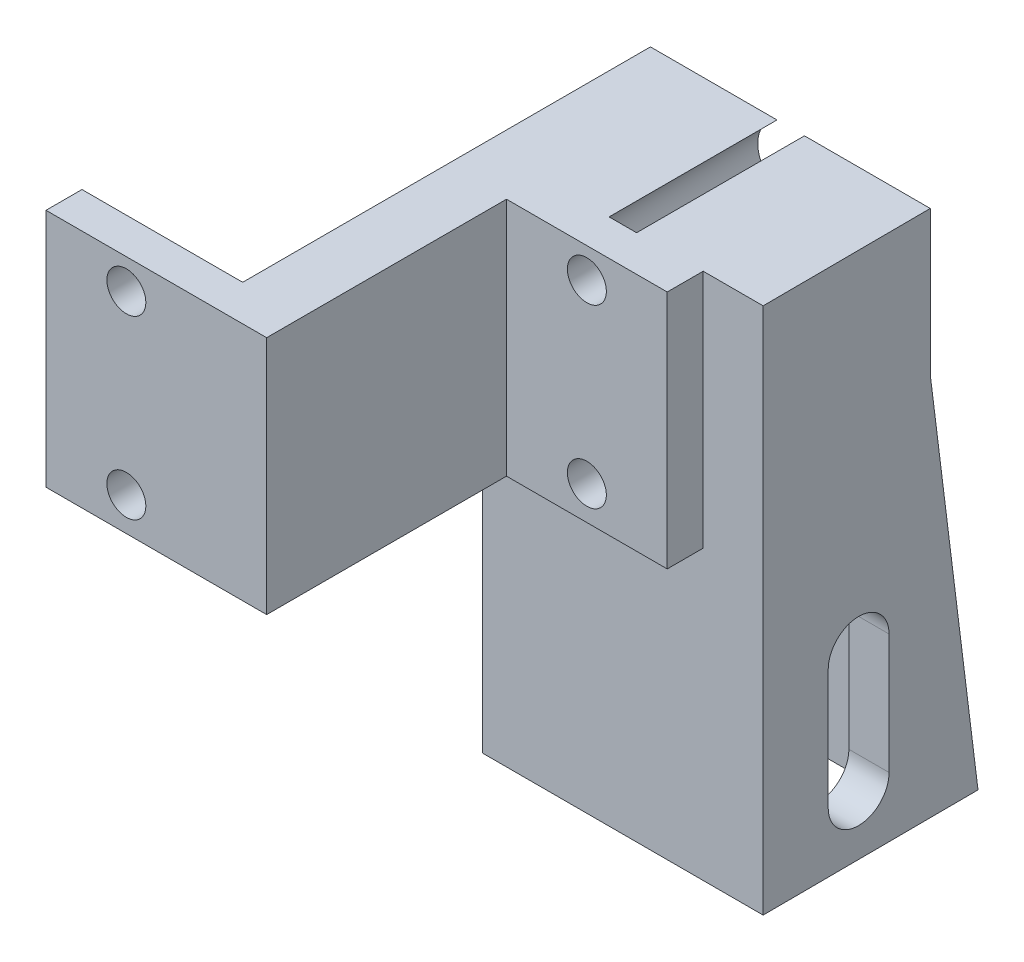
ISO-10303-21;
HEADER;
FILE_DESCRIPTION(('STEP AP214'),'2;1');
FILE_NAME('part.step','',(''),(''),'','','');
FILE_SCHEMA(('AUTOMOTIVE_DESIGN { 1 0 10303 214 1 1 1 1 }'));
ENDSEC;
DATA;
#1=APPLICATION_CONTEXT('core data for automotive mechanical design processes');
#2=APPLICATION_PROTOCOL_DEFINITION('international standard','automotive_design',2000,#1);
#3=PRODUCT_CONTEXT('',#1,'mechanical');
#4=PRODUCT('Part','Part','',(#3));
#5=PRODUCT_RELATED_PRODUCT_CATEGORY('part','',(#4));
#6=PRODUCT_DEFINITION_FORMATION('','',#4);
#7=PRODUCT_DEFINITION_CONTEXT('part definition',#1,'design');
#8=PRODUCT_DEFINITION('design','',#6,#7);
#9=PRODUCT_DEFINITION_SHAPE('','',#8);
#10=(LENGTH_UNIT() NAMED_UNIT(*) SI_UNIT(.MILLI.,.METRE.));
#11=(NAMED_UNIT(*) PLANE_ANGLE_UNIT() SI_UNIT($,.RADIAN.));
#12=(NAMED_UNIT(*) SI_UNIT($,.STERADIAN.) SOLID_ANGLE_UNIT());
#13=UNCERTAINTY_MEASURE_WITH_UNIT(LENGTH_MEASURE(1.E-05),#10,'distance_accuracy_value','');
#14=(GEOMETRIC_REPRESENTATION_CONTEXT(3) GLOBAL_UNCERTAINTY_ASSIGNED_CONTEXT((#13)) GLOBAL_UNIT_ASSIGNED_CONTEXT((#10,
#11,#12)) REPRESENTATION_CONTEXT('',''));
#15=CARTESIAN_POINT('',(0.,0.,0.));
#16=DIRECTION('',(0.,0.,1.));
#17=DIRECTION('',(1.,0.,0.));
#18=AXIS2_PLACEMENT_3D('',#15,#16,#17);
#19=CARTESIAN_POINT('',(0.,20.,-3.));
#20=DIRECTION('',(1.,0.,0.));
#21=DIRECTION('',(0.,0.,-1.));
#22=AXIS2_PLACEMENT_3D('',#19,#20,#21);
#23=PLANE('',#22);
#24=DIRECTION('',(0.,0.,1.));
#25=VECTOR('',#24,1.);
#26=CARTESIAN_POINT('',(0.,0.,-3.));
#27=LINE('',#26,#25);
#28=CARTESIAN_POINT('',(0.,0.,-3.));
#29=VERTEX_POINT('',#28);
#30=CARTESIAN_POINT('',(0.,0.,0.));
#31=VERTEX_POINT('',#30);
#32=EDGE_CURVE('E373',#29,#31,#27,.T.);
#33=ORIENTED_EDGE('',*,*,#32,.T.);
#34=DIRECTION('',(0.,-1.,0.));
#35=VECTOR('',#34,1.);
#36=CARTESIAN_POINT('',(0.,20.,0.));
#37=LINE('',#36,#35);
#38=CARTESIAN_POINT('',(0.,20.,0.));
#39=VERTEX_POINT('',#38);
#40=EDGE_CURVE('E446',#39,#31,#37,.T.);
#41=ORIENTED_EDGE('',*,*,#40,.F.);
#42=DIRECTION('',(0.,0.,1.));
#43=VECTOR('',#42,1.);
#44=CARTESIAN_POINT('',(0.,20.,-3.));
#45=LINE('',#44,#43);
#46=CARTESIAN_POINT('',(0.,20.,-3.));
#47=VERTEX_POINT('',#46);
#48=EDGE_CURVE('E374',#47,#39,#45,.T.);
#49=ORIENTED_EDGE('',*,*,#48,.F.);
#50=DIRECTION('',(0.,-1.,0.));
#51=VECTOR('',#50,1.);
#52=CARTESIAN_POINT('',(0.,20.,-3.));
#53=LINE('',#52,#51);
#54=EDGE_CURVE('E397',#47,#29,#53,.T.);
#55=ORIENTED_EDGE('',*,*,#54,.T.);
#56=EDGE_LOOP('',(#33,#41,#49,#55));
#57=FACE_BOUND('',#56,.T.);
#58=ADVANCED_FACE('F45',(#57),#23,.F.);
#59=CARTESIAN_POINT('',(0.,20.,0.));
#60=DIRECTION('',(0.,0.,-1.));
#61=DIRECTION('',(-1.,0.,0.));
#62=AXIS2_PLACEMENT_3D('',#59,#60,#61);
#63=PLANE('',#62);
#64=CARTESIAN_POINT('',(6.69999999999999,17.5,0.));
#65=DIRECTION('',(0.,0.,-1.));
#66=DIRECTION('',(-1.,0.,0.));
#67=AXIS2_PLACEMENT_3D('',#64,#65,#66);
#68=CIRCLE('',#67,1.625);
#69=CARTESIAN_POINT('',(5.07499999999999,17.5,0.));
#70=VERTEX_POINT('',#69);
#71=EDGE_CURVE('E349',#70,#70,#68,.T.);
#72=ORIENTED_EDGE('',*,*,#71,.T.);
#73=EDGE_LOOP('',(#72));
#74=FACE_BOUND('',#73,.T.);
#75=CARTESIAN_POINT('',(6.69999999999999,2.8,0.));
#76=DIRECTION('',(0.,0.,-1.));
#77=DIRECTION('',(-1.,0.,0.));
#78=AXIS2_PLACEMENT_3D('',#75,#76,#77);
#79=CIRCLE('',#78,1.625);
#80=CARTESIAN_POINT('',(5.07499999999999,2.8,0.));
#81=VERTEX_POINT('',#80);
#82=EDGE_CURVE('E296',#81,#81,#79,.T.);
#83=ORIENTED_EDGE('',*,*,#82,.T.);
#84=EDGE_LOOP('',(#83));
#85=FACE_BOUND('',#84,.T.);
#86=DIRECTION('',(1.,0.,0.));
#87=VECTOR('',#86,1.);
#88=CARTESIAN_POINT('',(0.,0.,0.));
#89=LINE('',#88,#87);
#90=CARTESIAN_POINT('',(18.4,0.,0.));
#91=VERTEX_POINT('',#90);
#92=EDGE_CURVE('E401',#31,#91,#89,.T.);
#93=ORIENTED_EDGE('',*,*,#92,.T.);
#94=DIRECTION('',(0.,-1.,0.));
#95=VECTOR('',#94,1.);
#96=CARTESIAN_POINT('',(18.4,20.,0.));
#97=LINE('',#96,#95);
#98=CARTESIAN_POINT('',(18.4,20.,0.));
#99=VERTEX_POINT('',#98);
#100=EDGE_CURVE('E442',#99,#91,#97,.T.);
#101=ORIENTED_EDGE('',*,*,#100,.F.);
#102=DIRECTION('',(1.,0.,0.));
#103=VECTOR('',#102,1.);
#104=CARTESIAN_POINT('',(0.,20.,0.));
#105=LINE('',#104,#103);
#106=EDGE_CURVE('E378',#39,#99,#105,.T.);
#107=ORIENTED_EDGE('',*,*,#106,.F.);
#108=ORIENTED_EDGE('',*,*,#40,.T.);
#109=EDGE_LOOP('',(#93,#101,#107,#108));
#110=FACE_BOUND('',#109,.T.);
#111=ADVANCED_FACE('F523',(#74,#85,#110),#63,.F.);
#112=CARTESIAN_POINT('',(18.4,20.,0.));
#113=DIRECTION('',(-1.,0.,0.));
#114=DIRECTION('',(0.,0.,1.));
#115=AXIS2_PLACEMENT_3D('',#112,#113,#114);
#116=PLANE('',#115);
#117=DIRECTION('',(0.,0.,-1.));
#118=VECTOR('',#117,1.);
#119=CARTESIAN_POINT('',(18.4,0.,0.));
#120=LINE('',#119,#118);
#121=CARTESIAN_POINT('',(18.4,0.,-20.));
#122=VERTEX_POINT('',#121);
#123=EDGE_CURVE('E404',#91,#122,#120,.T.);
#124=ORIENTED_EDGE('',*,*,#123,.T.);
#125=DIRECTION('',(0.,-1.,0.));
#126=VECTOR('',#125,1.);
#127=CARTESIAN_POINT('',(18.4,20.,-20.));
#128=LINE('',#127,#126);
#129=CARTESIAN_POINT('',(18.4,20.,-20.));
#130=VERTEX_POINT('',#129);
#131=EDGE_CURVE('E438',#130,#122,#128,.T.);
#132=ORIENTED_EDGE('',*,*,#131,.F.);
#133=DIRECTION('',(0.,0.,-1.));
#134=VECTOR('',#133,1.);
#135=CARTESIAN_POINT('',(18.4,20.,0.));
#136=LINE('',#135,#134);
#137=EDGE_CURVE('E382',#99,#130,#136,.T.);
#138=ORIENTED_EDGE('',*,*,#137,.F.);
#139=ORIENTED_EDGE('',*,*,#100,.T.);
#140=EDGE_LOOP('',(#124,#132,#138,#139));
#141=FACE_BOUND('',#140,.T.);
#142=ADVANCED_FACE('F525',(#141),#116,.F.);
#143=CARTESIAN_POINT('',(18.4,20.,-20.));
#144=DIRECTION('',(0.,0.,-1.));
#145=DIRECTION('',(-1.,0.,0.));
#146=AXIS2_PLACEMENT_3D('',#143,#144,#145);
#147=PLANE('',#146);
#148=CARTESIAN_POINT('',(25.1,17.5,-20.));
#149=DIRECTION('',(0.,0.,-1.));
#150=DIRECTION('',(-1.,0.,0.));
#151=AXIS2_PLACEMENT_3D('',#148,#149,#150);
#152=CIRCLE('',#151,1.625);
#153=CARTESIAN_POINT('',(23.475,17.5,-20.));
#154=VERTEX_POINT('',#153);
#155=EDGE_CURVE('E368',#154,#154,#152,.T.);
#156=ORIENTED_EDGE('',*,*,#155,.T.);
#157=EDGE_LOOP('',(#156));
#158=FACE_BOUND('',#157,.T.);
#159=CARTESIAN_POINT('',(25.1,2.8,-20.));
#160=DIRECTION('',(0.,0.,-1.));
#161=DIRECTION('',(-1.,0.,0.));
#162=AXIS2_PLACEMENT_3D('',#159,#160,#161);
#163=CIRCLE('',#162,1.625);
#164=CARTESIAN_POINT('',(23.475,2.8,-20.));
#165=VERTEX_POINT('',#164);
#166=EDGE_CURVE('E364',#165,#165,#163,.T.);
#167=ORIENTED_EDGE('',*,*,#166,.T.);
#168=EDGE_LOOP('',(#167));
#169=FACE_BOUND('',#168,.T.);
#170=DIRECTION('',(1.,0.,0.));
#171=VECTOR('',#170,1.);
#172=CARTESIAN_POINT('',(18.4,0.,-20.));
#173=LINE('',#172,#171);
#174=CARTESIAN_POINT('',(31.8,0.,-20.));
#175=VERTEX_POINT('',#174);
#176=EDGE_CURVE('E407',#122,#175,#173,.T.);
#177=ORIENTED_EDGE('',*,*,#176,.T.);
#178=DIRECTION('',(0.,-1.,0.));
#179=VECTOR('',#178,1.);
#180=CARTESIAN_POINT('',(31.8,20.,-20.));
#181=LINE('',#180,#179);
#182=CARTESIAN_POINT('',(31.8,20.,-20.));
#183=VERTEX_POINT('',#182);
#184=EDGE_CURVE('E434',#183,#175,#181,.T.);
#185=ORIENTED_EDGE('',*,*,#184,.F.);
#186=DIRECTION('',(1.,0.,0.));
#187=VECTOR('',#186,1.);
#188=CARTESIAN_POINT('',(18.4,20.,-20.));
#189=LINE('',#188,#187);
#190=EDGE_CURVE('E385',#130,#183,#189,.T.);
#191=ORIENTED_EDGE('',*,*,#190,.F.);
#192=ORIENTED_EDGE('',*,*,#131,.T.);
#193=EDGE_LOOP('',(#177,#185,#191,#192));
#194=FACE_BOUND('',#193,.T.);
#195=ADVANCED_FACE('F530',(#158,#169,#194),#147,.F.);
#196=CARTESIAN_POINT('',(31.8,20.,-20.));
#197=DIRECTION('',(-1.,0.,0.));
#198=DIRECTION('',(0.,0.,1.));
#199=AXIS2_PLACEMENT_3D('',#196,#197,#198);
#200=PLANE('',#199);
#201=DIRECTION('',(0.,0.,-1.));
#202=VECTOR('',#201,1.);
#203=CARTESIAN_POINT('',(31.8,0.,-20.));
#204=LINE('',#203,#202);
#205=CARTESIAN_POINT('',(31.8,0.,-23.));
#206=VERTEX_POINT('',#205);
#207=EDGE_CURVE('E410',#175,#206,#204,.T.);
#208=ORIENTED_EDGE('',*,*,#207,.T.);
#209=DIRECTION('',(0.,-1.,0.));
#210=VECTOR('',#209,1.);
#211=CARTESIAN_POINT('',(31.8,20.,-23.));
#212=LINE('',#211,#210);
#213=CARTESIAN_POINT('',(31.8,20.,-23.));
#214=VERTEX_POINT('',#213);
#215=EDGE_CURVE('E430',#214,#206,#212,.T.);
#216=ORIENTED_EDGE('',*,*,#215,.F.);
#217=DIRECTION('',(0.,0.,-1.));
#218=VECTOR('',#217,1.);
#219=CARTESIAN_POINT('',(31.8,20.,-20.));
#220=LINE('',#219,#218);
#221=EDGE_CURVE('E388',#183,#214,#220,.T.);
#222=ORIENTED_EDGE('',*,*,#221,.F.);
#223=ORIENTED_EDGE('',*,*,#184,.T.);
#224=EDGE_LOOP('',(#208,#216,#222,#223));
#225=FACE_BOUND('',#224,.T.);
#226=ADVANCED_FACE('F534',(#225),#200,.F.);
#227=CARTESIAN_POINT('',(13.4,20.,-23.));
#228=DIRECTION('',(1.,0.,0.));
#229=DIRECTION('',(0.,0.,-1.));
#230=AXIS2_PLACEMENT_3D('',#227,#228,#229);
#231=PLANE('',#230);
#232=CARTESIAN_POINT('',(13.4,-9.,-31.));
#233=DIRECTION('',(-1.,0.,0.));
#234=DIRECTION('',(0.,0.,-1.));
#235=AXIS2_PLACEMENT_3D('',#232,#233,#234);
#236=CIRCLE('',#235,6.);
#237=CARTESIAN_POINT('',(13.4,-9.,-25.));
#238=VERTEX_POINT('',#237);
#239=CARTESIAN_POINT('',(13.4,-9.,-37.));
#240=VERTEX_POINT('',#239);
#241=EDGE_CURVE('E199',#238,#240,#236,.T.);
#242=ORIENTED_EDGE('',*,*,#241,.F.);
#243=DIRECTION('',(0.,1.,0.));
#244=VECTOR('',#243,1.);
#245=CARTESIAN_POINT('',(13.4,-24.,-25.));
#246=LINE('',#245,#244);
#247=CARTESIAN_POINT('',(13.4,-24.,-25.));
#248=VERTEX_POINT('',#247);
#249=EDGE_CURVE('E215',#248,#238,#246,.T.);
#250=ORIENTED_EDGE('',*,*,#249,.F.);
#251=DIRECTION('',(0.,0.,1.));
#252=VECTOR('',#251,1.);
#253=CARTESIAN_POINT('',(13.4,-24.,-23.));
#254=LINE('',#253,#252);
#255=CARTESIAN_POINT('',(13.4,-24.,-23.));
#256=VERTEX_POINT('',#255);
#257=EDGE_CURVE('E323',#248,#256,#254,.T.);
#258=ORIENTED_EDGE('',*,*,#257,.T.);
#259=DIRECTION('',(0.,1.,0.));
#260=VECTOR('',#259,1.);
#261=CARTESIAN_POINT('',(13.4,20.,-23.));
#262=LINE('',#261,#260);
#263=CARTESIAN_POINT('',(13.4,0.,-23.));
#264=VERTEX_POINT('',#263);
#265=EDGE_CURVE('E328',#256,#264,#262,.T.);
#266=ORIENTED_EDGE('',*,*,#265,.T.);
#267=DIRECTION('',(0.,0.,1.));
#268=VECTOR('',#267,1.);
#269=CARTESIAN_POINT('',(13.4,0.,-23.));
#270=LINE('',#269,#268);
#271=CARTESIAN_POINT('',(13.4,0.,-3.));
#272=VERTEX_POINT('',#271);
#273=EDGE_CURVE('E418',#264,#272,#270,.T.);
#274=ORIENTED_EDGE('',*,*,#273,.T.);
#275=DIRECTION('',(0.,-1.,0.));
#276=VECTOR('',#275,1.);
#277=CARTESIAN_POINT('',(13.4,20.,-3.));
#278=LINE('',#277,#276);
#279=CARTESIAN_POINT('',(13.4,20.,-3.));
#280=VERTEX_POINT('',#279);
#281=EDGE_CURVE('E426',#280,#272,#278,.T.);
#282=ORIENTED_EDGE('',*,*,#281,.F.);
#283=DIRECTION('',(0.,0.,1.));
#284=VECTOR('',#283,1.);
#285=CARTESIAN_POINT('',(13.4,20.,-23.));
#286=LINE('',#285,#284);
#287=CARTESIAN_POINT('',(13.4,20.,-37.));
#288=VERTEX_POINT('',#287);
#289=EDGE_CURVE('E391',#288,#280,#286,.T.);
#290=ORIENTED_EDGE('',*,*,#289,.F.);
#291=DIRECTION('',(0.,-1.,0.));
#292=VECTOR('',#291,1.);
#293=CARTESIAN_POINT('',(13.4,8.,-37.));
#294=LINE('',#293,#292);
#295=CARTESIAN_POINT('',(13.4,8.,-37.));
#296=VERTEX_POINT('',#295);
#297=EDGE_CURVE('E302',#288,#296,#294,.T.);
#298=ORIENTED_EDGE('',*,*,#297,.T.);
#299=DIRECTION('',(0.,-0.992277876713668,-0.124034734589208));
#300=VECTOR('',#299,1.);
#301=CARTESIAN_POINT('',(13.4,-24.,-41.));
#302=LINE('',#301,#300);
#303=CARTESIAN_POINT('',(13.4,-24.,-41.));
#304=VERTEX_POINT('',#303);
#305=EDGE_CURVE('E319',#296,#304,#302,.T.);
#306=ORIENTED_EDGE('',*,*,#305,.T.);
#307=CARTESIAN_POINT('',(13.4,-24.,-37.));
#308=VERTEX_POINT('',#307);
#309=EDGE_CURVE('E324',#304,#308,#254,.T.);
#310=ORIENTED_EDGE('',*,*,#309,.T.);
#311=DIRECTION('',(0.,-1.,0.));
#312=VECTOR('',#311,1.);
#313=CARTESIAN_POINT('',(13.4,-9.,-37.));
#314=LINE('',#313,#312);
#315=EDGE_CURVE('E219',#240,#308,#314,.T.);
#316=ORIENTED_EDGE('',*,*,#315,.F.);
#317=EDGE_LOOP('',(#242,#250,#258,#266,#274,#282,#290,#298,#306,#310,#316));
#318=FACE_BOUND('',#317,.T.);
#319=ADVANCED_FACE('F485',(#318),#231,.F.);
#320=CARTESIAN_POINT('',(13.4,20.,-3.));
#321=DIRECTION('',(0.,0.,1.));
#322=DIRECTION('',(1.,0.,0.));
#323=AXIS2_PLACEMENT_3D('',#320,#321,#322);
#324=PLANE('',#323);
#325=CARTESIAN_POINT('',(6.69999999999999,17.5,-3.));
#326=DIRECTION('',(0.,0.,1.));
#327=DIRECTION('',(1.,0.,0.));
#328=AXIS2_PLACEMENT_3D('',#325,#326,#327);
#329=CIRCLE('',#328,1.625);
#330=CARTESIAN_POINT('',(8.32499999999999,17.5,-3.));
#331=VERTEX_POINT('',#330);
#332=EDGE_CURVE('E369',#331,#331,#329,.F.);
#333=ORIENTED_EDGE('',*,*,#332,.F.);
#334=EDGE_LOOP('',(#333));
#335=FACE_BOUND('',#334,.T.);
#336=CARTESIAN_POINT('',(6.69999999999999,2.8,-3.));
#337=DIRECTION('',(0.,0.,1.));
#338=DIRECTION('',(1.,0.,0.));
#339=AXIS2_PLACEMENT_3D('',#336,#337,#338);
#340=CIRCLE('',#339,1.625);
#341=CARTESIAN_POINT('',(8.32499999999999,2.8,-3.));
#342=VERTEX_POINT('',#341);
#343=EDGE_CURVE('E353',#342,#342,#340,.F.);
#344=ORIENTED_EDGE('',*,*,#343,.F.);
#345=EDGE_LOOP('',(#344));
#346=FACE_BOUND('',#345,.T.);
#347=DIRECTION('',(-1.,0.,0.));
#348=VECTOR('',#347,1.);
#349=CARTESIAN_POINT('',(13.4,0.,-3.));
#350=LINE('',#349,#348);
#351=EDGE_CURVE('E379',#272,#29,#350,.T.);
#352=ORIENTED_EDGE('',*,*,#351,.T.);
#353=ORIENTED_EDGE('',*,*,#54,.F.);
#354=DIRECTION('',(-1.,0.,0.));
#355=VECTOR('',#354,1.);
#356=CARTESIAN_POINT('',(13.4,20.,-3.));
#357=LINE('',#356,#355);
#358=EDGE_CURVE('E394',#280,#47,#357,.T.);
#359=ORIENTED_EDGE('',*,*,#358,.F.);
#360=ORIENTED_EDGE('',*,*,#281,.T.);
#361=EDGE_LOOP('',(#352,#353,#359,#360));
#362=FACE_BOUND('',#361,.T.);
#363=ADVANCED_FACE('F511',(#335,#346,#362),#324,.F.);
#364=CARTESIAN_POINT('',(0.,20.,0.));
#365=DIRECTION('',(0.,1.,0.));
#366=DIRECTION('',(0.,0.,1.));
#367=AXIS2_PLACEMENT_3D('',#364,#365,#366);
#368=PLANE('',#367);
#369=DIRECTION('',(-0.00471237153936623,0.,-0.999988896715596));
#370=VECTOR('',#369,1.);
#371=CARTESIAN_POINT('',(36.8,20.,-23.));
#372=LINE('',#371,#370);
#373=CARTESIAN_POINT('',(36.8,20.,-23.));
#374=VERTEX_POINT('',#373);
#375=CARTESIAN_POINT('',(36.7340260659215,20.,-37.));
#376=VERTEX_POINT('',#375);
#377=EDGE_CURVE('E252',#374,#376,#372,.T.);
#378=ORIENTED_EDGE('',*,*,#377,.T.);
#379=DIRECTION('',(-1.,0.,0.));
#380=VECTOR('',#379,1.);
#381=CARTESIAN_POINT('',(89.3394572960189,20.,-37.));
#382=LINE('',#381,#380);
#383=CARTESIAN_POINT('',(26.245643923739,20.,-37.));
#384=VERTEX_POINT('',#383);
#385=EDGE_CURVE('E346',#376,#384,#382,.T.);
#386=ORIENTED_EDGE('',*,*,#385,.T.);
#387=DIRECTION('',(0.,0.,1.));
#388=VECTOR('',#387,1.);
#389=CARTESIAN_POINT('',(26.245643923739,20.,-41.));
#390=LINE('',#389,#388);
#391=CARTESIAN_POINT('',(26.245643923739,20.,-23.));
#392=VERTEX_POINT('',#391);
#393=EDGE_CURVE('E282',#392,#384,#390,.F.);
#394=ORIENTED_EDGE('',*,*,#393,.F.);
#395=DIRECTION('',(1.,0.,0.));
#396=VECTOR('',#395,1.);
#397=CARTESIAN_POINT('',(0.,20.,-23.));
#398=LINE('',#397,#396);
#399=CARTESIAN_POINT('',(23.954356076261,20.,-23.));
#400=VERTEX_POINT('',#399);
#401=EDGE_CURVE('E53',#400,#392,#398,.T.);
#402=ORIENTED_EDGE('',*,*,#401,.F.);
#403=DIRECTION('',(0.,0.,1.));
#404=VECTOR('',#403,1.);
#405=CARTESIAN_POINT('',(23.954356076261,20.,-41.));
#406=LINE('',#405,#404);
#407=CARTESIAN_POINT('',(23.954356076261,20.,-37.));
#408=VERTEX_POINT('',#407);
#409=EDGE_CURVE('E289',#408,#400,#406,.T.);
#410=ORIENTED_EDGE('',*,*,#409,.F.);
#411=EDGE_CURVE('E332',#408,#288,#382,.T.);
#412=ORIENTED_EDGE('',*,*,#411,.T.);
#413=ORIENTED_EDGE('',*,*,#289,.T.);
#414=ORIENTED_EDGE('',*,*,#358,.T.);
#415=ORIENTED_EDGE('',*,*,#48,.T.);
#416=ORIENTED_EDGE('',*,*,#106,.T.);
#417=ORIENTED_EDGE('',*,*,#137,.T.);
#418=ORIENTED_EDGE('',*,*,#190,.T.);
#419=ORIENTED_EDGE('',*,*,#221,.T.);
#420=DIRECTION('',(-1.,0.,0.));
#421=VECTOR('',#420,1.);
#422=CARTESIAN_POINT('',(89.3394572960189,20.,-23.));
#423=LINE('',#422,#421);
#424=EDGE_CURVE('E297',#374,#214,#423,.T.);
#425=ORIENTED_EDGE('',*,*,#424,.F.);
#426=EDGE_LOOP('',(#378,#386,#394,#402,#410,#412,#413,#414,#415,#416,#417,#418,#419,#425));
#427=FACE_BOUND('',#426,.T.);
#428=ADVANCED_FACE('F472',(#427),#368,.T.);
#429=CARTESIAN_POINT('',(0.,0.,0.));
#430=DIRECTION('',(0.,1.,0.));
#431=DIRECTION('',(0.,0.,1.));
#432=AXIS2_PLACEMENT_3D('',#429,#430,#431);
#433=PLANE('',#432);
#434=ORIENTED_EDGE('',*,*,#32,.F.);
#435=ORIENTED_EDGE('',*,*,#351,.F.);
#436=ORIENTED_EDGE('',*,*,#273,.F.);
#437=DIRECTION('',(-1.,0.,0.));
#438=VECTOR('',#437,1.);
#439=CARTESIAN_POINT('',(31.8,0.,-23.));
#440=LINE('',#439,#438);
#441=EDGE_CURVE('E414',#206,#264,#440,.T.);
#442=ORIENTED_EDGE('',*,*,#441,.F.);
#443=ORIENTED_EDGE('',*,*,#207,.F.);
#444=ORIENTED_EDGE('',*,*,#176,.F.);
#445=ORIENTED_EDGE('',*,*,#123,.F.);
#446=ORIENTED_EDGE('',*,*,#92,.F.);
#447=EDGE_LOOP('',(#434,#435,#436,#442,#443,#444,#445,#446));
#448=FACE_BOUND('',#447,.T.);
#449=ADVANCED_FACE('F514',(#448),#433,.F.);
#450=CARTESIAN_POINT('',(25.1,2.8,-23.));
#451=DIRECTION('',(0.,0.,1.));
#452=DIRECTION('',(1.,0.,0.));
#453=AXIS2_PLACEMENT_3D('',#450,#451,#452);
#454=CYLINDRICAL_SURFACE('',#453,1.625);
#455=CARTESIAN_POINT('',(25.1,2.8,-23.));
#456=DIRECTION('',(0.,0.,1.));
#457=DIRECTION('',(1.,0.,0.));
#458=AXIS2_PLACEMENT_3D('',#455,#456,#457);
#459=CIRCLE('',#458,1.625);
#460=CARTESIAN_POINT('',(26.725,2.8,-23.));
#461=VERTEX_POINT('',#460);
#462=EDGE_CURVE('E315',#461,#461,#459,.T.);
#463=ORIENTED_EDGE('',*,*,#462,.F.);
#464=EDGE_LOOP('',(#463));
#465=FACE_BOUND('',#464,.T.);
#466=ORIENTED_EDGE('',*,*,#166,.F.);
#467=EDGE_LOOP('',(#466));
#468=FACE_BOUND('',#467,.T.);
#469=ADVANCED_FACE('F587',(#465,#468),#454,.F.);
#470=CARTESIAN_POINT('',(25.1,17.5,-23.));
#471=DIRECTION('',(0.,0.,1.));
#472=DIRECTION('',(1.,0.,0.));
#473=AXIS2_PLACEMENT_3D('',#470,#471,#472);
#474=CYLINDRICAL_SURFACE('',#473,1.625);
#475=CARTESIAN_POINT('',(25.1,17.5,-23.));
#476=DIRECTION('',(0.,0.,1.));
#477=DIRECTION('',(1.,0.,0.));
#478=AXIS2_PLACEMENT_3D('',#475,#476,#477);
#479=CIRCLE('',#478,1.625);
#480=CARTESIAN_POINT('',(26.725,17.5,-23.));
#481=VERTEX_POINT('',#480);
#482=EDGE_CURVE('E357',#481,#481,#479,.T.);
#483=ORIENTED_EDGE('',*,*,#482,.F.);
#484=EDGE_LOOP('',(#483));
#485=FACE_BOUND('',#484,.T.);
#486=ORIENTED_EDGE('',*,*,#155,.F.);
#487=EDGE_LOOP('',(#486));
#488=FACE_BOUND('',#487,.T.);
#489=ADVANCED_FACE('F592',(#485,#488),#474,.F.);
#490=CARTESIAN_POINT('',(6.69999999999999,2.8,-23.));
#491=DIRECTION('',(0.,0.,1.));
#492=DIRECTION('',(1.,0.,0.));
#493=AXIS2_PLACEMENT_3D('',#490,#491,#492);
#494=CYLINDRICAL_SURFACE('',#493,1.625);
#495=ORIENTED_EDGE('',*,*,#82,.F.);
#496=EDGE_LOOP('',(#495));
#497=FACE_BOUND('',#496,.T.);
#498=ORIENTED_EDGE('',*,*,#343,.T.);
#499=EDGE_LOOP('',(#498));
#500=FACE_BOUND('',#499,.T.);
#501=ADVANCED_FACE('F596',(#497,#500),#494,.F.);
#502=CARTESIAN_POINT('',(6.69999999999999,17.5,-23.));
#503=DIRECTION('',(0.,0.,1.));
#504=DIRECTION('',(1.,0.,0.));
#505=AXIS2_PLACEMENT_3D('',#502,#503,#504);
#506=CYLINDRICAL_SURFACE('',#505,1.625);
#507=ORIENTED_EDGE('',*,*,#71,.F.);
#508=EDGE_LOOP('',(#507));
#509=FACE_BOUND('',#508,.T.);
#510=ORIENTED_EDGE('',*,*,#332,.T.);
#511=EDGE_LOOP('',(#510));
#512=FACE_BOUND('',#511,.T.);
#513=ADVANCED_FACE('F561',(#509,#512),#506,.F.);
#514=CARTESIAN_POINT('',(89.3394572960189,-9.,-31.));
#515=DIRECTION('',(-1.,0.,0.));
#516=DIRECTION('',(0.,0.,1.));
#517=AXIS2_PLACEMENT_3D('',#514,#515,#516);
#518=CYLINDRICAL_SURFACE('',#517,2.55);
#519=DIRECTION('',(-1.,0.,0.));
#520=VECTOR('',#519,1.);
#521=CARTESIAN_POINT('',(89.3394572960189,-9.,-28.45));
#522=LINE('',#521,#520);
#523=CARTESIAN_POINT('',(36.774317289948,-9.,-28.45));
#524=VERTEX_POINT('',#523);
#525=CARTESIAN_POINT('',(33.4,-9.,-28.45));
#526=VERTEX_POINT('',#525);
#527=EDGE_CURVE('E298',#524,#526,#522,.T.);
#528=ORIENTED_EDGE('',*,*,#527,.T.);
#529=CARTESIAN_POINT('',(33.4,-9.,-31.));
#530=DIRECTION('',(1.,0.,0.));
#531=DIRECTION('',(0.,0.,-1.));
#532=AXIS2_PLACEMENT_3D('',#529,#530,#531);
#533=CIRCLE('',#532,2.55);
#534=CARTESIAN_POINT('',(33.4,-9.,-33.55));
#535=VERTEX_POINT('',#534);
#536=EDGE_CURVE('E247',#526,#535,#533,.F.);
#537=ORIENTED_EDGE('',*,*,#536,.T.);
#538=DIRECTION('',(-1.,0.,0.));
#539=VECTOR('',#538,1.);
#540=CARTESIAN_POINT('',(89.3394572960189,-9.,-33.55));
#541=LINE('',#540,#539);
#542=CARTESIAN_POINT('',(36.750283928248,-9.,-33.55));
#543=VERTEX_POINT('',#542);
#544=EDGE_CURVE('E311',#543,#535,#541,.T.);
#545=ORIENTED_EDGE('',*,*,#544,.F.);
#546=CARTESIAN_POINT('',(36.762300609098,-9.,-31.));
#547=DIRECTION('',(-0.999988896715596,0.,0.00471237153936623));
#548=DIRECTION('',(-0.00471237153936623,0.,-0.999988896715596));
#549=AXIS2_PLACEMENT_3D('',#546,#547,#548);
#550=ELLIPSE('',#549,2.5500283136896,2.55);
#551=EDGE_CURVE('E273',#543,#524,#550,.F.);
#552=ORIENTED_EDGE('',*,*,#551,.T.);
#553=EDGE_LOOP('',(#528,#537,#545,#552));
#554=FACE_BOUND('',#553,.T.);
#555=ADVANCED_FACE('F550',(#554),#518,.F.);
#556=CARTESIAN_POINT('',(89.3394572960189,-9.,-28.45));
#557=DIRECTION('',(0.,0.,1.));
#558=DIRECTION('',(1.,0.,0.));
#559=AXIS2_PLACEMENT_3D('',#556,#557,#558);
#560=PLANE('',#559);
#561=DIRECTION('',(-1.,0.,0.));
#562=VECTOR('',#561,1.);
#563=CARTESIAN_POINT('',(89.3394572960189,-19.,-28.45));
#564=LINE('',#563,#562);
#565=CARTESIAN_POINT('',(36.774317289948,-19.,-28.45));
#566=VERTEX_POINT('',#565);
#567=CARTESIAN_POINT('',(33.4,-19.,-28.45));
#568=VERTEX_POINT('',#567);
#569=EDGE_CURVE('E303',#566,#568,#564,.T.);
#570=ORIENTED_EDGE('',*,*,#569,.T.);
#571=DIRECTION('',(0.,1.,0.));
#572=VECTOR('',#571,1.);
#573=CARTESIAN_POINT('',(33.4,-9.,-28.45));
#574=LINE('',#573,#572);
#575=EDGE_CURVE('E243',#568,#526,#574,.T.);
#576=ORIENTED_EDGE('',*,*,#575,.T.);
#577=ORIENTED_EDGE('',*,*,#527,.F.);
#578=DIRECTION('',(0.,-1.,0.));
#579=VECTOR('',#578,1.);
#580=CARTESIAN_POINT('',(36.774317289948,-9.,-28.45));
#581=LINE('',#580,#579);
#582=EDGE_CURVE('E269',#524,#566,#581,.T.);
#583=ORIENTED_EDGE('',*,*,#582,.T.);
#584=EDGE_LOOP('',(#570,#576,#577,#583));
#585=FACE_BOUND('',#584,.T.);
#586=ADVANCED_FACE('F553',(#585),#560,.F.);
#587=CARTESIAN_POINT('',(89.3394572960189,-19.,-31.));
#588=DIRECTION('',(-1.,0.,0.));
#589=DIRECTION('',(0.,0.,1.));
#590=AXIS2_PLACEMENT_3D('',#587,#588,#589);
#591=CYLINDRICAL_SURFACE('',#590,2.55);
#592=DIRECTION('',(-1.,0.,0.));
#593=VECTOR('',#592,1.);
#594=CARTESIAN_POINT('',(89.3394572960189,-19.,-33.55));
#595=LINE('',#594,#593);
#596=CARTESIAN_POINT('',(36.750283928248,-19.,-33.55));
#597=VERTEX_POINT('',#596);
#598=CARTESIAN_POINT('',(33.4,-19.,-33.55));
#599=VERTEX_POINT('',#598);
#600=EDGE_CURVE('E307',#597,#599,#595,.T.);
#601=ORIENTED_EDGE('',*,*,#600,.T.);
#602=CARTESIAN_POINT('',(33.4,-19.,-31.));
#603=DIRECTION('',(1.,0.,0.));
#604=DIRECTION('',(0.,0.,-1.));
#605=AXIS2_PLACEMENT_3D('',#602,#603,#604);
#606=CIRCLE('',#605,2.55);
#607=EDGE_CURVE('E60',#599,#568,#606,.F.);
#608=ORIENTED_EDGE('',*,*,#607,.T.);
#609=ORIENTED_EDGE('',*,*,#569,.F.);
#610=CARTESIAN_POINT('',(36.762300609098,-19.,-31.));
#611=DIRECTION('',(-0.999988896715596,0.,0.00471237153936623));
#612=DIRECTION('',(-0.00471237153936623,0.,-0.999988896715596));
#613=AXIS2_PLACEMENT_3D('',#610,#611,#612);
#614=ELLIPSE('',#613,2.5500283136896,2.55);
#615=EDGE_CURVE('E265',#566,#597,#614,.F.);
#616=ORIENTED_EDGE('',*,*,#615,.T.);
#617=EDGE_LOOP('',(#601,#608,#609,#616));
#618=FACE_BOUND('',#617,.T.);
#619=ADVANCED_FACE('F547',(#618),#591,.F.);
#620=CARTESIAN_POINT('',(89.3394572960189,-9.,-33.55));
#621=DIRECTION('',(0.,0.,-1.));
#622=DIRECTION('',(-1.,0.,0.));
#623=AXIS2_PLACEMENT_3D('',#620,#621,#622);
#624=PLANE('',#623);
#625=ORIENTED_EDGE('',*,*,#544,.T.);
#626=DIRECTION('',(0.,-1.,0.));
#627=VECTOR('',#626,1.);
#628=CARTESIAN_POINT('',(33.4,-9.,-33.55));
#629=LINE('',#628,#627);
#630=EDGE_CURVE('E233',#535,#599,#629,.T.);
#631=ORIENTED_EDGE('',*,*,#630,.T.);
#632=ORIENTED_EDGE('',*,*,#600,.F.);
#633=DIRECTION('',(0.,1.,0.));
#634=VECTOR('',#633,1.);
#635=CARTESIAN_POINT('',(36.750283928248,-9.,-33.55));
#636=LINE('',#635,#634);
#637=EDGE_CURVE('E261',#597,#543,#636,.T.);
#638=ORIENTED_EDGE('',*,*,#637,.T.);
#639=EDGE_LOOP('',(#625,#631,#632,#638));
#640=FACE_BOUND('',#639,.T.);
#641=ADVANCED_FACE('F548',(#640),#624,.F.);
#642=CARTESIAN_POINT('',(89.3394572960189,20.,-23.));
#643=DIRECTION('',(0.,0.,1.));
#644=DIRECTION('',(0.,-1.,0.));
#645=AXIS2_PLACEMENT_3D('',#642,#643,#644);
#646=PLANE('',#645);
#647=ORIENTED_EDGE('',*,*,#215,.T.);
#648=ORIENTED_EDGE('',*,*,#441,.T.);
#649=ORIENTED_EDGE('',*,*,#265,.F.);
#650=DIRECTION('',(-1.,0.,0.));
#651=VECTOR('',#650,1.);
#652=CARTESIAN_POINT('',(89.3394572960189,-24.,-23.));
#653=LINE('',#652,#651);
#654=CARTESIAN_POINT('',(36.8,-24.,-23.));
#655=VERTEX_POINT('',#654);
#656=EDGE_CURVE('E336',#655,#256,#653,.T.);
#657=ORIENTED_EDGE('',*,*,#656,.F.);
#658=DIRECTION('',(0.,-1.,0.));
#659=VECTOR('',#658,1.);
#660=CARTESIAN_POINT('',(36.8,20.,-23.));
#661=LINE('',#660,#659);
#662=EDGE_CURVE('E293',#374,#655,#661,.T.);
#663=ORIENTED_EDGE('',*,*,#662,.F.);
#664=ORIENTED_EDGE('',*,*,#424,.T.);
#665=EDGE_LOOP('',(#647,#648,#649,#657,#663,#664));
#666=FACE_BOUND('',#665,.T.);
#667=ADVANCED_FACE('F507',(#666),#646,.T.);
#668=CARTESIAN_POINT('',(89.3394572960189,-24.,-23.));
#669=DIRECTION('',(0.,-1.,0.));
#670=DIRECTION('',(0.,0.,-1.));
#671=AXIS2_PLACEMENT_3D('',#668,#669,#670);
#672=PLANE('',#671);
#673=DIRECTION('',(-1.,0.,0.));
#674=VECTOR('',#673,1.);
#675=CARTESIAN_POINT('',(33.4,-24.,-25.));
#676=LINE('',#675,#674);
#677=CARTESIAN_POINT('',(33.4,-24.,-25.));
#678=VERTEX_POINT('',#677);
#679=EDGE_CURVE('E234',#678,#248,#676,.T.);
#680=ORIENTED_EDGE('',*,*,#679,.F.);
#681=DIRECTION('',(0.,0.,1.));
#682=VECTOR('',#681,1.);
#683=CARTESIAN_POINT('',(33.4,-24.,-37.));
#684=LINE('',#683,#682);
#685=CARTESIAN_POINT('',(33.4,-24.,-37.));
#686=VERTEX_POINT('',#685);
#687=EDGE_CURVE('E210',#686,#678,#684,.T.);
#688=ORIENTED_EDGE('',*,*,#687,.F.);
#689=DIRECTION('',(-1.,0.,0.));
#690=VECTOR('',#689,1.);
#691=CARTESIAN_POINT('',(33.4,-24.,-37.));
#692=LINE('',#691,#690);
#693=EDGE_CURVE('E203',#686,#308,#692,.T.);
#694=ORIENTED_EDGE('',*,*,#693,.T.);
#695=ORIENTED_EDGE('',*,*,#309,.F.);
#696=DIRECTION('',(-1.,0.,0.));
#697=VECTOR('',#696,1.);
#698=CARTESIAN_POINT('',(89.3394572960189,-24.,-41.));
#699=LINE('',#698,#697);
#700=CARTESIAN_POINT('',(36.7151763704705,-24.,-41.));
#701=VERTEX_POINT('',#700);
#702=EDGE_CURVE('E340',#701,#304,#699,.T.);
#703=ORIENTED_EDGE('',*,*,#702,.F.);
#704=DIRECTION('',(-0.00471237153936623,0.,-0.999988896715596));
#705=VECTOR('',#704,1.);
#706=CARTESIAN_POINT('',(36.8,-24.,-23.));
#707=LINE('',#706,#705);
#708=EDGE_CURVE('E251',#655,#701,#707,.T.);
#709=ORIENTED_EDGE('',*,*,#708,.F.);
#710=ORIENTED_EDGE('',*,*,#656,.T.);
#711=ORIENTED_EDGE('',*,*,#257,.F.);
#712=EDGE_LOOP('',(#680,#688,#694,#695,#703,#709,#710,#711));
#713=FACE_BOUND('',#712,.T.);
#714=ADVANCED_FACE('F496',(#713),#672,.T.);
#715=CARTESIAN_POINT('',(89.3394572960189,-24.,-41.));
#716=DIRECTION('',(0.,0.124034734589208,-0.992277876713668));
#717=DIRECTION('',(0.,0.992277876713668,0.124034734589208));
#718=AXIS2_PLACEMENT_3D('',#715,#716,#717);
#719=PLANE('',#718);
#720=DIRECTION('',(0.000584504143241365,0.992277707210219,0.124034713401277));
#721=VECTOR('',#720,1.);
#722=CARTESIAN_POINT('',(36.7151943492979,-23.9694784206191,-40.9961848025774));
#723=LINE('',#722,#721);
#724=CARTESIAN_POINT('',(36.7340260659215,8.,-37.));
#725=VERTEX_POINT('',#724);
#726=EDGE_CURVE('E256',#701,#725,#723,.T.);
#727=ORIENTED_EDGE('',*,*,#726,.F.);
#728=ORIENTED_EDGE('',*,*,#702,.T.);
#729=ORIENTED_EDGE('',*,*,#305,.F.);
#730=DIRECTION('',(-1.,0.,0.));
#731=VECTOR('',#730,1.);
#732=CARTESIAN_POINT('',(89.3394572960189,8.,-37.));
#733=LINE('',#732,#731);
#734=EDGE_CURVE('E343',#725,#296,#733,.T.);
#735=ORIENTED_EDGE('',*,*,#734,.F.);
#736=EDGE_LOOP('',(#727,#728,#729,#735));
#737=FACE_BOUND('',#736,.T.);
#738=CARTESIAN_POINT('',(25.1,2.8,-37.65));
#739=DIRECTION('',(0.,0.124034734589208,-0.992277876713668));
#740=DIRECTION('',(0.,0.992277876713668,0.124034734589208));
#741=AXIS2_PLACEMENT_3D('',#738,#739,#740);
#742=ELLIPSE('',#741,2.77140110097762,2.75);
#743=CARTESIAN_POINT('',(25.1,5.55,-37.30625));
#744=VERTEX_POINT('',#743);
#745=EDGE_CURVE('E292',#744,#744,#742,.T.);
#746=ORIENTED_EDGE('',*,*,#745,.F.);
#747=EDGE_LOOP('',(#746));
#748=FACE_BOUND('',#747,.T.);
#749=ADVANCED_FACE('F490',(#737,#748),#719,.T.);
#750=CARTESIAN_POINT('',(89.3394572960189,8.,-37.));
#751=DIRECTION('',(0.,0.,-1.));
#752=DIRECTION('',(-1.,0.,0.));
#753=AXIS2_PLACEMENT_3D('',#750,#751,#752);
#754=PLANE('',#753);
#755=DIRECTION('',(0.,1.,0.));
#756=VECTOR('',#755,1.);
#757=CARTESIAN_POINT('',(36.7340260659215,8.,-37.));
#758=LINE('',#757,#756);
#759=EDGE_CURVE('E13',#725,#376,#758,.T.);
#760=ORIENTED_EDGE('',*,*,#759,.F.);
#761=ORIENTED_EDGE('',*,*,#734,.T.);
#762=ORIENTED_EDGE('',*,*,#297,.F.);
#763=ORIENTED_EDGE('',*,*,#411,.F.);
#764=CARTESIAN_POINT('',(25.1,17.5,-37.));
#765=DIRECTION('',(0.,0.,-1.));
#766=DIRECTION('',(-1.,0.,0.));
#767=AXIS2_PLACEMENT_3D('',#764,#765,#766);
#768=CIRCLE('',#767,2.75);
#769=EDGE_CURVE('E450',#384,#408,#768,.T.);
#770=ORIENTED_EDGE('',*,*,#769,.F.);
#771=ORIENTED_EDGE('',*,*,#385,.F.);
#772=EDGE_LOOP('',(#760,#761,#762,#763,#770,#771));
#773=FACE_BOUND('',#772,.T.);
#774=ADVANCED_FACE('F477',(#773),#754,.T.);
#775=CARTESIAN_POINT('',(25.1,17.5,-41.));
#776=DIRECTION('',(0.,0.,1.));
#777=DIRECTION('',(1.,0.,0.));
#778=AXIS2_PLACEMENT_3D('',#775,#776,#777);
#779=CYLINDRICAL_SURFACE('',#778,2.75);
#780=ORIENTED_EDGE('',*,*,#409,.T.);
#781=CARTESIAN_POINT('',(25.1,17.5,-23.));
#782=DIRECTION('',(0.,0.,1.));
#783=DIRECTION('',(1.,0.,0.));
#784=AXIS2_PLACEMENT_3D('',#781,#782,#783);
#785=CIRCLE('',#784,2.75);
#786=EDGE_CURVE('E278',#400,#392,#785,.T.);
#787=ORIENTED_EDGE('',*,*,#786,.T.);
#788=ORIENTED_EDGE('',*,*,#393,.T.);
#789=ORIENTED_EDGE('',*,*,#769,.T.);
#790=EDGE_LOOP('',(#780,#787,#788,#789));
#791=FACE_BOUND('',#790,.T.);
#792=ADVANCED_FACE('F470',(#791),#779,.F.);
#793=CARTESIAN_POINT('',(25.1,17.5,-23.));
#794=DIRECTION('',(0.,0.,1.));
#795=DIRECTION('',(1.,0.,0.));
#796=AXIS2_PLACEMENT_3D('',#793,#794,#795);
#797=PLANE('',#796);
#798=ORIENTED_EDGE('',*,*,#482,.T.);
#799=EDGE_LOOP('',(#798));
#800=FACE_BOUND('',#799,.T.);
#801=ORIENTED_EDGE('',*,*,#401,.T.);
#802=ORIENTED_EDGE('',*,*,#786,.F.);
#803=EDGE_LOOP('',(#801,#802));
#804=FACE_BOUND('',#803,.T.);
#805=ADVANCED_FACE('F465',(#800,#804),#797,.F.);
#806=CARTESIAN_POINT('',(25.1,2.8,-41.));
#807=DIRECTION('',(0.,0.,1.));
#808=DIRECTION('',(1.,0.,0.));
#809=AXIS2_PLACEMENT_3D('',#806,#807,#808);
#810=CYLINDRICAL_SURFACE('',#809,2.75);
#811=ORIENTED_EDGE('',*,*,#745,.T.);
#812=EDGE_LOOP('',(#811));
#813=FACE_BOUND('',#812,.T.);
#814=CARTESIAN_POINT('',(25.1,2.8,-23.));
#815=DIRECTION('',(0.,0.,1.));
#816=DIRECTION('',(1.,0.,0.));
#817=AXIS2_PLACEMENT_3D('',#814,#815,#816);
#818=CIRCLE('',#817,2.75);
#819=CARTESIAN_POINT('',(27.85,2.8,-23.));
#820=VERTEX_POINT('',#819);
#821=EDGE_CURVE('E277',#820,#820,#818,.T.);
#822=ORIENTED_EDGE('',*,*,#821,.T.);
#823=EDGE_LOOP('',(#822));
#824=FACE_BOUND('',#823,.T.);
#825=ADVANCED_FACE('F674',(#813,#824),#810,.F.);
#826=CARTESIAN_POINT('',(25.1,2.8,-23.));
#827=DIRECTION('',(0.,0.,1.));
#828=DIRECTION('',(1.,0.,0.));
#829=AXIS2_PLACEMENT_3D('',#826,#827,#828);
#830=PLANE('',#829);
#831=ORIENTED_EDGE('',*,*,#462,.T.);
#832=EDGE_LOOP('',(#831));
#833=FACE_BOUND('',#832,.T.);
#834=ORIENTED_EDGE('',*,*,#821,.F.);
#835=EDGE_LOOP('',(#834));
#836=FACE_BOUND('',#835,.T.);
#837=ADVANCED_FACE('F540',(#833,#836),#830,.F.);
#838=CARTESIAN_POINT('',(36.8,20.,-23.));
#839=DIRECTION('',(-0.999988896715596,0.,0.00471237153936623));
#840=DIRECTION('',(0.00471237153936623,0.,0.999988896715596));
#841=AXIS2_PLACEMENT_3D('',#838,#839,#840);
#842=PLANE('',#841);
#843=ORIENTED_EDGE('',*,*,#726,.T.);
#844=ORIENTED_EDGE('',*,*,#759,.T.);
#845=ORIENTED_EDGE('',*,*,#377,.F.);
#846=ORIENTED_EDGE('',*,*,#662,.T.);
#847=ORIENTED_EDGE('',*,*,#708,.T.);
#848=EDGE_LOOP('',(#843,#844,#845,#846,#847));
#849=FACE_BOUND('',#848,.T.);
#850=ORIENTED_EDGE('',*,*,#637,.F.);
#851=ORIENTED_EDGE('',*,*,#615,.F.);
#852=ORIENTED_EDGE('',*,*,#582,.F.);
#853=ORIENTED_EDGE('',*,*,#551,.F.);
#854=EDGE_LOOP('',(#850,#851,#852,#853));
#855=FACE_BOUND('',#854,.T.);
#856=ADVANCED_FACE('F537',(#849,#855),#842,.F.);
#857=CARTESIAN_POINT('',(33.4,-9.,-31.));
#858=DIRECTION('',(1.,0.,0.));
#859=DIRECTION('',(0.,0.,-1.));
#860=AXIS2_PLACEMENT_3D('',#857,#858,#859);
#861=PLANE('',#860);
#862=CARTESIAN_POINT('',(33.4,-9.,-31.));
#863=DIRECTION('',(-1.,0.,0.));
#864=DIRECTION('',(0.,0.,-1.));
#865=AXIS2_PLACEMENT_3D('',#862,#863,#864);
#866=CIRCLE('',#865,6.);
#867=CARTESIAN_POINT('',(33.4,-9.,-25.));
#868=VERTEX_POINT('',#867);
#869=CARTESIAN_POINT('',(33.4,-9.,-37.));
#870=VERTEX_POINT('',#869);
#871=EDGE_CURVE('E196',#868,#870,#866,.T.);
#872=ORIENTED_EDGE('',*,*,#871,.T.);
#873=DIRECTION('',(0.,-1.,0.));
#874=VECTOR('',#873,1.);
#875=CARTESIAN_POINT('',(33.4,-9.,-37.));
#876=LINE('',#875,#874);
#877=EDGE_CURVE('E68',#870,#686,#876,.T.);
#878=ORIENTED_EDGE('',*,*,#877,.T.);
#879=ORIENTED_EDGE('',*,*,#687,.T.);
#880=DIRECTION('',(0.,1.,0.));
#881=VECTOR('',#880,1.);
#882=CARTESIAN_POINT('',(33.4,-24.,-25.));
#883=LINE('',#882,#881);
#884=EDGE_CURVE('E204',#678,#868,#883,.T.);
#885=ORIENTED_EDGE('',*,*,#884,.T.);
#886=EDGE_LOOP('',(#872,#878,#879,#885));
#887=FACE_BOUND('',#886,.T.);
#888=ORIENTED_EDGE('',*,*,#575,.F.);
#889=ORIENTED_EDGE('',*,*,#607,.F.);
#890=ORIENTED_EDGE('',*,*,#630,.F.);
#891=ORIENTED_EDGE('',*,*,#536,.F.);
#892=EDGE_LOOP('',(#888,#889,#890,#891));
#893=FACE_BOUND('',#892,.T.);
#894=ADVANCED_FACE('F212',(#887,#893),#861,.F.);
#895=CARTESIAN_POINT('',(33.4,-9.,-31.));
#896=DIRECTION('',(-1.,0.,0.));
#897=DIRECTION('',(0.,0.,1.));
#898=AXIS2_PLACEMENT_3D('',#895,#896,#897);
#899=CYLINDRICAL_SURFACE('',#898,6.);
#900=ORIENTED_EDGE('',*,*,#241,.T.);
#901=DIRECTION('',(-1.,0.,0.));
#902=VECTOR('',#901,1.);
#903=CARTESIAN_POINT('',(33.4,-9.,-37.));
#904=LINE('',#903,#902);
#905=EDGE_CURVE('E194',#870,#240,#904,.T.);
#906=ORIENTED_EDGE('',*,*,#905,.F.);
#907=ORIENTED_EDGE('',*,*,#871,.F.);
#908=DIRECTION('',(-1.,0.,0.));
#909=VECTOR('',#908,1.);
#910=CARTESIAN_POINT('',(33.4,-9.,-25.));
#911=LINE('',#910,#909);
#912=EDGE_CURVE('E230',#868,#238,#911,.T.);
#913=ORIENTED_EDGE('',*,*,#912,.T.);
#914=EDGE_LOOP('',(#900,#906,#907,#913));
#915=FACE_BOUND('',#914,.T.);
#916=ADVANCED_FACE('F195',(#915),#899,.F.);
#917=CARTESIAN_POINT('',(33.4,-24.,-25.));
#918=DIRECTION('',(0.,0.,1.));
#919=DIRECTION('',(1.,0.,0.));
#920=AXIS2_PLACEMENT_3D('',#917,#918,#919);
#921=PLANE('',#920);
#922=ORIENTED_EDGE('',*,*,#249,.T.);
#923=ORIENTED_EDGE('',*,*,#912,.F.);
#924=ORIENTED_EDGE('',*,*,#884,.F.);
#925=ORIENTED_EDGE('',*,*,#679,.T.);
#926=EDGE_LOOP('',(#922,#923,#924,#925));
#927=FACE_BOUND('',#926,.T.);
#928=ADVANCED_FACE('F500',(#927),#921,.F.);
#929=CARTESIAN_POINT('',(33.4,-9.,-37.));
#930=DIRECTION('',(0.,0.,-1.));
#931=DIRECTION('',(-1.,0.,0.));
#932=AXIS2_PLACEMENT_3D('',#929,#930,#931);
#933=PLANE('',#932);
#934=ORIENTED_EDGE('',*,*,#315,.T.);
#935=ORIENTED_EDGE('',*,*,#693,.F.);
#936=ORIENTED_EDGE('',*,*,#877,.F.);
#937=ORIENTED_EDGE('',*,*,#905,.T.);
#938=EDGE_LOOP('',(#934,#935,#936,#937));
#939=FACE_BOUND('',#938,.T.);
#940=ADVANCED_FACE('F206',(#939),#933,.F.);
#941=CLOSED_SHELL('',(#58,#111,#142,#195,#226,#319,#363,#428,#449,#469,#489,#501,#513,#555,#586,
#619,#641,#667,#714,#749,#774,#792,#805,#825,#837,#856,#894,#916,#928,#940));
#942=MANIFOLD_SOLID_BREP('B2',#941);
#943=ADVANCED_BREP_SHAPE_REPRESENTATION('',(#18,#942),#14);
#944=SHAPE_DEFINITION_REPRESENTATION(#9,#943);
ENDSEC;
END-ISO-10303-21;
